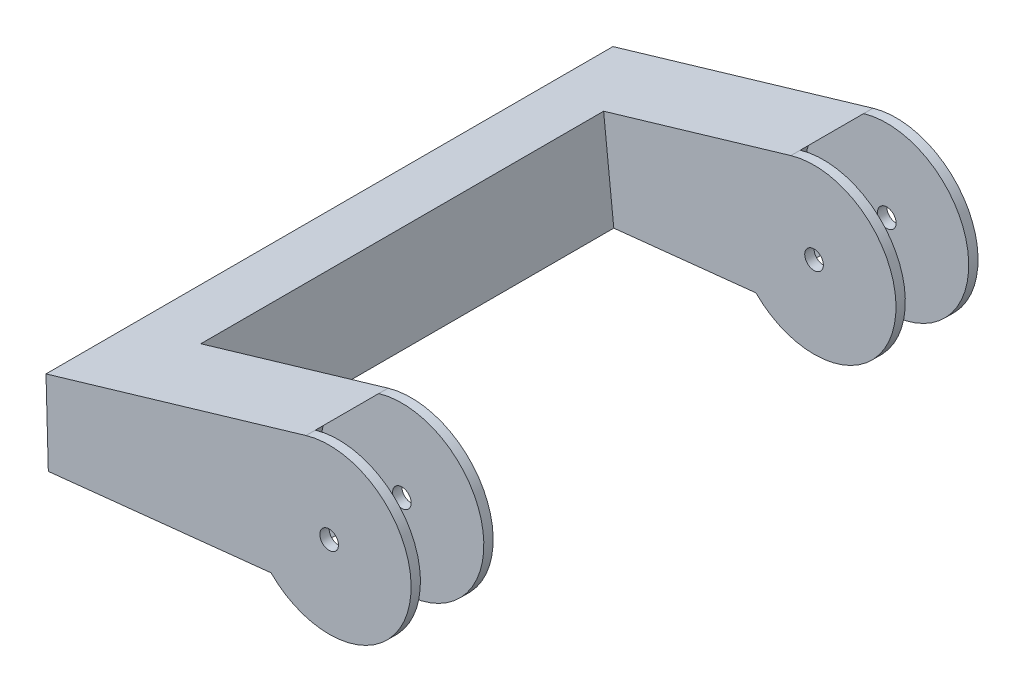
ISO-10303-21;
HEADER;
FILE_DESCRIPTION(('STEP AP214'),'2;1');
FILE_NAME('part.step','',(''),(''),'','','');
FILE_SCHEMA(('AUTOMOTIVE_DESIGN { 1 0 10303 214 1 1 1 1 }'));
ENDSEC;
DATA;
#1=APPLICATION_CONTEXT('core data for automotive mechanical design processes');
#2=APPLICATION_PROTOCOL_DEFINITION('international standard','automotive_design',2000,#1);
#3=PRODUCT_CONTEXT('',#1,'mechanical');
#4=PRODUCT('Part','Part','',(#3));
#5=PRODUCT_RELATED_PRODUCT_CATEGORY('part','',(#4));
#6=PRODUCT_DEFINITION_FORMATION('','',#4);
#7=PRODUCT_DEFINITION_CONTEXT('part definition',#1,'design');
#8=PRODUCT_DEFINITION('design','',#6,#7);
#9=PRODUCT_DEFINITION_SHAPE('','',#8);
#10=(LENGTH_UNIT() NAMED_UNIT(*) SI_UNIT(.MILLI.,.METRE.));
#11=(NAMED_UNIT(*) PLANE_ANGLE_UNIT() SI_UNIT($,.RADIAN.));
#12=(NAMED_UNIT(*) SI_UNIT($,.STERADIAN.) SOLID_ANGLE_UNIT());
#13=UNCERTAINTY_MEASURE_WITH_UNIT(LENGTH_MEASURE(1.E-05),#10,'distance_accuracy_value','');
#14=(GEOMETRIC_REPRESENTATION_CONTEXT(3) GLOBAL_UNCERTAINTY_ASSIGNED_CONTEXT((#13)) GLOBAL_UNIT_ASSIGNED_CONTEXT((#10,
#11,#12)) REPRESENTATION_CONTEXT('',''));
#15=CARTESIAN_POINT('',(0.,0.,0.));
#16=DIRECTION('',(0.,0.,1.));
#17=DIRECTION('',(1.,0.,0.));
#18=AXIS2_PLACEMENT_3D('',#15,#16,#17);
#19=CARTESIAN_POINT('',(0.,0.,-11.));
#20=DIRECTION('',(0.,0.,1.));
#21=DIRECTION('',(1.,0.,0.));
#22=AXIS2_PLACEMENT_3D('',#19,#20,#21);
#23=PLANE('',#22);
#24=CARTESIAN_POINT('',(0.,0.,-11.));
#25=DIRECTION('',(0.,0.,1.));
#26=DIRECTION('',(1.,0.,0.));
#27=AXIS2_PLACEMENT_3D('',#24,#25,#26);
#28=CIRCLE('',#27,2.5);
#29=CARTESIAN_POINT('',(2.5,0.,-11.));
#30=VERTEX_POINT('',#29);
#31=EDGE_CURVE('E254',#30,#30,#28,.T.);
#32=ORIENTED_EDGE('',*,*,#31,.T.);
#33=EDGE_LOOP('',(#32));
#34=FACE_BOUND('',#33,.T.);
#35=DIRECTION('',(0.105116484730748,-0.99445991605386,0.));
#36=VECTOR('',#35,1.);
#37=CARTESIAN_POINT('',(-55.1330063569683,-5.82767362195887,-11.));
#38=LINE('',#37,#36);
#39=CARTESIAN_POINT('',(-56.4126612267271,6.27856716052013,-11.));
#40=VERTEX_POINT('',#39);
#41=CARTESIAN_POINT('',(-53.6859194237052,-19.5179140619969,-11.));
#42=VERTEX_POINT('',#41);
#43=EDGE_CURVE('E54',#40,#42,#38,.T.);
#44=ORIENTED_EDGE('',*,*,#43,.F.);
#45=DIRECTION('',(-0.959213834506893,-0.282681480982719,0.));
#46=VECTOR('',#45,1.);
#47=CARTESIAN_POINT('',(-75.916524457056,0.530754999670662,-11.));
#48=LINE('',#47,#46);
#49=CARTESIAN_POINT('',(-6.21031513731404,21.073259470872,-11.));
#50=VERTEX_POINT('',#49);
#51=EDGE_CURVE('E217',#50,#40,#48,.T.);
#52=ORIENTED_EDGE('',*,*,#51,.F.);
#53=CARTESIAN_POINT('',(0.,0.,-11.));
#54=DIRECTION('',(0.,0.,1.));
#55=DIRECTION('',(1.,0.,0.));
#56=AXIS2_PLACEMENT_3D('',#53,#54,#55);
#57=CIRCLE('',#56,21.9693031029992);
#58=CARTESIAN_POINT('',(-15.5792034190395,-15.4899547985021,-11.));
#59=VERTEX_POINT('',#58);
#60=EDGE_CURVE('E229',#59,#50,#57,.T.);
#61=ORIENTED_EDGE('',*,*,#60,.F.);
#62=DIRECTION('',(0.99445991605386,0.105116484730748,0.));
#63=VECTOR('',#62,1.);
#64=CARTESIAN_POINT('',(-75.2941351020167,-21.8019474722333,-11.));
#65=LINE('',#64,#63);
#66=EDGE_CURVE('E230',#42,#59,#65,.T.);
#67=ORIENTED_EDGE('',*,*,#66,.F.);
#68=EDGE_LOOP('',(#44,#52,#61,#67));
#69=FACE_BOUND('',#68,.T.);
#70=ADVANCED_FACE('F37',(#34,#69),#23,.F.);
#71=CARTESIAN_POINT('',(0.,0.,11.));
#72=DIRECTION('',(0.,0.,-1.));
#73=DIRECTION('',(-1.,0.,0.));
#74=AXIS2_PLACEMENT_3D('',#71,#72,#73);
#75=CYLINDRICAL_SURFACE('',#74,21.9693031029992);
#76=CARTESIAN_POINT('',(0.,0.,-8.50000000000006));
#77=DIRECTION('',(0.,0.,1.));
#78=DIRECTION('',(1.,0.,0.));
#79=AXIS2_PLACEMENT_3D('',#76,#77,#78);
#80=CIRCLE('',#79,21.9693031029992);
#81=CARTESIAN_POINT('',(-15.5792034190395,-15.4899547985021,-8.50000000000006));
#82=VERTEX_POINT('',#81);
#83=CARTESIAN_POINT('',(-6.21031513731404,21.073259470872,-8.50000000000006));
#84=VERTEX_POINT('',#83);
#85=EDGE_CURVE('E358',#82,#84,#80,.T.);
#86=ORIENTED_EDGE('',*,*,#85,.F.);
#87=DIRECTION('',(0.,0.,-1.));
#88=VECTOR('',#87,1.);
#89=CARTESIAN_POINT('',(-15.5792034190395,-15.4899547985021,11.));
#90=LINE('',#89,#88);
#91=EDGE_CURVE('E46',#82,#59,#90,.T.);
#92=ORIENTED_EDGE('',*,*,#91,.T.);
#93=ORIENTED_EDGE('',*,*,#60,.T.);
#94=DIRECTION('',(0.,0.,-1.));
#95=VECTOR('',#94,1.);
#96=CARTESIAN_POINT('',(-6.21031513731404,21.073259470872,11.));
#97=LINE('',#96,#95);
#98=EDGE_CURVE('E241',#84,#50,#97,.T.);
#99=ORIENTED_EDGE('',*,*,#98,.F.);
#100=EDGE_LOOP('',(#86,#92,#93,#99));
#101=FACE_BOUND('',#100,.T.);
#102=ADVANCED_FACE('F311',(#101),#75,.T.);
#103=CARTESIAN_POINT('',(0.,0.,11.));
#104=DIRECTION('',(0.,0.,-1.));
#105=DIRECTION('',(-1.,0.,0.));
#106=AXIS2_PLACEMENT_3D('',#103,#104,#105);
#107=CYLINDRICAL_SURFACE('',#106,2.5);
#108=ORIENTED_EDGE('',*,*,#31,.F.);
#109=EDGE_LOOP('',(#108));
#110=FACE_BOUND('',#109,.T.);
#111=CARTESIAN_POINT('',(0.,0.,-8.50000000000006));
#112=DIRECTION('',(0.,0.,1.));
#113=DIRECTION('',(1.,0.,0.));
#114=AXIS2_PLACEMENT_3D('',#111,#112,#113);
#115=CIRCLE('',#114,2.5);
#116=CARTESIAN_POINT('',(2.5,0.,-8.50000000000006));
#117=VERTEX_POINT('',#116);
#118=EDGE_CURVE('E248',#117,#117,#115,.T.);
#119=ORIENTED_EDGE('',*,*,#118,.T.);
#120=EDGE_LOOP('',(#119));
#121=FACE_BOUND('',#120,.T.);
#122=ADVANCED_FACE('F317',(#110,#121),#107,.F.);
#123=CARTESIAN_POINT('',(0.,0.,11.));
#124=DIRECTION('',(0.,0.,1.));
#125=DIRECTION('',(1.,0.,0.));
#126=AXIS2_PLACEMENT_3D('',#123,#124,#125);
#127=PLANE('',#126);
#128=DIRECTION('',(0.99445991605386,0.105116484730748,0.));
#129=VECTOR('',#128,1.);
#130=CARTESIAN_POINT('',(-75.2941351020167,-21.8019474722333,11.));
#131=LINE('',#130,#129);
#132=CARTESIAN_POINT('',(-75.2941351020167,-21.8019474722333,11.));
#133=VERTEX_POINT('',#132);
#134=CARTESIAN_POINT('',(-15.5792034190395,-15.4899547985021,11.));
#135=VERTEX_POINT('',#134);
#136=EDGE_CURVE('E228',#133,#135,#131,.T.);
#137=ORIENTED_EDGE('',*,*,#136,.T.);
#138=CARTESIAN_POINT('',(0.,0.,11.));
#139=DIRECTION('',(0.,0.,1.));
#140=DIRECTION('',(1.,0.,0.));
#141=AXIS2_PLACEMENT_3D('',#138,#139,#140);
#142=CIRCLE('',#141,21.9693031029992);
#143=CARTESIAN_POINT('',(-6.21031513731404,21.073259470872,11.));
#144=VERTEX_POINT('',#143);
#145=EDGE_CURVE('E266',#135,#144,#142,.T.);
#146=ORIENTED_EDGE('',*,*,#145,.T.);
#147=DIRECTION('',(-0.959213834506893,-0.282681480982719,0.));
#148=VECTOR('',#147,1.);
#149=CARTESIAN_POINT('',(-75.916524457056,0.530754999670662,11.));
#150=LINE('',#149,#148);
#151=CARTESIAN_POINT('',(-75.916524457056,0.530754999670662,11.));
#152=VERTEX_POINT('',#151);
#153=EDGE_CURVE('E268',#144,#152,#150,.T.);
#154=ORIENTED_EDGE('',*,*,#153,.T.);
#155=DIRECTION('',(0.0278581509804419,-0.99961188639589,0.));
#156=VECTOR('',#155,1.);
#157=CARTESIAN_POINT('',(-75.2941351020167,-21.8019474722333,11.));
#158=LINE('',#157,#156);
#159=EDGE_CURVE('E239',#152,#133,#158,.T.);
#160=ORIENTED_EDGE('',*,*,#159,.T.);
#161=EDGE_LOOP('',(#137,#146,#154,#160));
#162=FACE_BOUND('',#161,.T.);
#163=CARTESIAN_POINT('',(0.,0.,11.));
#164=DIRECTION('',(0.,0.,1.));
#165=DIRECTION('',(1.,0.,0.));
#166=AXIS2_PLACEMENT_3D('',#163,#164,#165);
#167=CIRCLE('',#166,2.5);
#168=CARTESIAN_POINT('',(2.5,0.,11.));
#169=VERTEX_POINT('',#168);
#170=EDGE_CURVE('E259',#169,#169,#167,.T.);
#171=ORIENTED_EDGE('',*,*,#170,.F.);
#172=EDGE_LOOP('',(#171));
#173=FACE_BOUND('',#172,.T.);
#174=ADVANCED_FACE('F274',(#162,#173),#127,.T.);
#175=CARTESIAN_POINT('',(-75.2941351020167,-21.8019474722333,11.));
#176=DIRECTION('',(-0.105116484730748,0.99445991605386,0.));
#177=DIRECTION('',(-0.99445991605386,-0.105116484730748,0.));
#178=AXIS2_PLACEMENT_3D('',#175,#176,#177);
#179=PLANE('',#178);
#180=DIRECTION('',(0.,0.,-1.));
#181=VECTOR('',#180,1.);
#182=CARTESIAN_POINT('',(-75.2941351020167,-21.8019474722333,11.));
#183=LINE('',#182,#181);
#184=CARTESIAN_POINT('',(-75.2941351020167,-21.8019474722333,-141.));
#185=VERTEX_POINT('',#184);
#186=EDGE_CURVE('E236',#133,#185,#183,.T.);
#187=ORIENTED_EDGE('',*,*,#186,.T.);
#188=DIRECTION('',(0.99445991605386,0.105116484730748,0.));
#189=VECTOR('',#188,1.);
#190=CARTESIAN_POINT('',(-75.2941351020167,-21.8019474722333,-141.));
#191=LINE('',#190,#189);
#192=CARTESIAN_POINT('',(-15.5792034190395,-15.4899547985021,-141.));
#193=VERTEX_POINT('',#192);
#194=EDGE_CURVE('E179',#185,#193,#191,.T.);
#195=ORIENTED_EDGE('',*,*,#194,.T.);
#196=DIRECTION('',(0.,0.,1.));
#197=VECTOR('',#196,1.);
#198=CARTESIAN_POINT('',(-15.5792034190395,-15.4899547985021,-141.));
#199=LINE('',#198,#197);
#200=CARTESIAN_POINT('',(-15.5792034190395,-15.4899547985021,-138.5));
#201=VERTEX_POINT('',#200);
#202=EDGE_CURVE('E199',#193,#201,#199,.T.);
#203=ORIENTED_EDGE('',*,*,#202,.T.);
#204=DIRECTION('',(0.,0.,-1.));
#205=VECTOR('',#204,1.);
#206=CARTESIAN_POINT('',(-15.5792034190395,-15.4899547985021,-121.5));
#207=LINE('',#206,#205);
#208=CARTESIAN_POINT('',(-15.5792034190395,-15.4899547985021,-121.5));
#209=VERTEX_POINT('',#208);
#210=EDGE_CURVE('E170',#209,#201,#207,.T.);
#211=ORIENTED_EDGE('',*,*,#210,.F.);
#212=CARTESIAN_POINT('',(-15.5792034190395,-15.4899547985021,-119.));
#213=VERTEX_POINT('',#212);
#214=EDGE_CURVE('E142',#209,#213,#199,.T.);
#215=ORIENTED_EDGE('',*,*,#214,.T.);
#216=DIRECTION('',(0.99445991605386,0.105116484730748,0.));
#217=VECTOR('',#216,1.);
#218=CARTESIAN_POINT('',(-75.2941351020167,-21.8019474722333,-119.));
#219=LINE('',#218,#217);
#220=CARTESIAN_POINT('',(-53.6859194237052,-19.5179140619969,-119.));
#221=VERTEX_POINT('',#220);
#222=EDGE_CURVE('E139',#221,#213,#219,.T.);
#223=ORIENTED_EDGE('',*,*,#222,.F.);
#224=DIRECTION('',(0.,0.,1.));
#225=VECTOR('',#224,1.);
#226=CARTESIAN_POINT('',(-53.6859194237052,-19.5179140619969,-100.815012246112));
#227=LINE('',#226,#225);
#228=EDGE_CURVE('E129',#221,#42,#227,.T.);
#229=ORIENTED_EDGE('',*,*,#228,.T.);
#230=ORIENTED_EDGE('',*,*,#66,.T.);
#231=ORIENTED_EDGE('',*,*,#91,.F.);
#232=DIRECTION('',(0.,0.,1.));
#233=VECTOR('',#232,1.);
#234=CARTESIAN_POINT('',(-15.5792034190395,-15.4899547985021,-8.50000000000006));
#235=LINE('',#234,#233);
#236=CARTESIAN_POINT('',(-15.5792034190395,-15.4899547985021,8.50000000000006));
#237=VERTEX_POINT('',#236);
#238=EDGE_CURVE('E250',#82,#237,#235,.T.);
#239=ORIENTED_EDGE('',*,*,#238,.T.);
#240=EDGE_CURVE('E11',#135,#237,#90,.T.);
#241=ORIENTED_EDGE('',*,*,#240,.F.);
#242=ORIENTED_EDGE('',*,*,#136,.F.);
#243=EDGE_LOOP('',(#187,#195,#203,#211,#215,#223,#229,#230,#231,#239,#241,#242));
#244=FACE_BOUND('',#243,.T.);
#245=ADVANCED_FACE('F39',(#244),#179,.F.);
#246=ORIENTED_EDGE('',*,*,#240,.T.);
#247=CARTESIAN_POINT('',(0.,0.,8.50000000000006));
#248=DIRECTION('',(0.,0.,1.));
#249=DIRECTION('',(1.,0.,0.));
#250=AXIS2_PLACEMENT_3D('',#247,#248,#249);
#251=CIRCLE('',#250,21.9693031029992);
#252=CARTESIAN_POINT('',(-6.21031513731404,21.073259470872,8.50000000000006));
#253=VERTEX_POINT('',#252);
#254=EDGE_CURVE('E218',#237,#253,#251,.T.);
#255=ORIENTED_EDGE('',*,*,#254,.T.);
#256=EDGE_CURVE('E242',#144,#253,#97,.T.);
#257=ORIENTED_EDGE('',*,*,#256,.F.);
#258=ORIENTED_EDGE('',*,*,#145,.F.);
#259=EDGE_LOOP('',(#246,#255,#257,#258));
#260=FACE_BOUND('',#259,.T.);
#261=ADVANCED_FACE('F284',(#260),#75,.T.);
#262=CARTESIAN_POINT('',(-75.916524457056,0.530754999670662,11.));
#263=DIRECTION('',(0.282681480982719,-0.959213834506893,0.));
#264=DIRECTION('',(0.959213834506893,0.282681480982719,0.));
#265=AXIS2_PLACEMENT_3D('',#262,#263,#264);
#266=PLANE('',#265);
#267=ORIENTED_EDGE('',*,*,#51,.T.);
#268=DIRECTION('',(0.,0.,1.));
#269=VECTOR('',#268,1.);
#270=CARTESIAN_POINT('',(-56.4126612267271,6.27856716052013,-100.815012246112));
#271=LINE('',#270,#269);
#272=CARTESIAN_POINT('',(-56.4126612267271,6.27856716052013,-119.));
#273=VERTEX_POINT('',#272);
#274=EDGE_CURVE('E136',#273,#40,#271,.T.);
#275=ORIENTED_EDGE('',*,*,#274,.F.);
#276=DIRECTION('',(-0.959213834506893,-0.282681480982719,0.));
#277=VECTOR('',#276,1.);
#278=CARTESIAN_POINT('',(-75.916524457056,0.530754999670662,-119.));
#279=LINE('',#278,#277);
#280=CARTESIAN_POINT('',(-6.21031513731404,21.073259470872,-119.));
#281=VERTEX_POINT('',#280);
#282=EDGE_CURVE('E152',#281,#273,#279,.T.);
#283=ORIENTED_EDGE('',*,*,#282,.F.);
#284=DIRECTION('',(0.,0.,1.));
#285=VECTOR('',#284,1.);
#286=CARTESIAN_POINT('',(-6.21031513731404,21.073259470872,-141.));
#287=LINE('',#286,#285);
#288=CARTESIAN_POINT('',(-6.21031513731404,21.073259470872,-121.5));
#289=VERTEX_POINT('',#288);
#290=EDGE_CURVE('E191',#289,#281,#287,.T.);
#291=ORIENTED_EDGE('',*,*,#290,.F.);
#292=CARTESIAN_POINT('',(-6.21031513731404,21.073259470872,-138.5));
#293=VERTEX_POINT('',#292);
#294=EDGE_CURVE('E204',#293,#289,#287,.T.);
#295=ORIENTED_EDGE('',*,*,#294,.F.);
#296=CARTESIAN_POINT('',(-6.21031513731404,21.073259470872,-141.));
#297=VERTEX_POINT('',#296);
#298=EDGE_CURVE('E202',#297,#293,#287,.T.);
#299=ORIENTED_EDGE('',*,*,#298,.F.);
#300=DIRECTION('',(-0.959213834506893,-0.282681480982719,0.));
#301=VECTOR('',#300,1.);
#302=CARTESIAN_POINT('',(-75.916524457056,0.530754999670662,-141.));
#303=LINE('',#302,#301);
#304=CARTESIAN_POINT('',(-75.916524457056,0.530754999670662,-141.));
#305=VERTEX_POINT('',#304);
#306=EDGE_CURVE('E185',#297,#305,#303,.T.);
#307=ORIENTED_EDGE('',*,*,#306,.T.);
#308=DIRECTION('',(0.,0.,-1.));
#309=VECTOR('',#308,1.);
#310=CARTESIAN_POINT('',(-75.916524457056,0.530754999670662,11.));
#311=LINE('',#310,#309);
#312=EDGE_CURVE('E238',#152,#305,#311,.T.);
#313=ORIENTED_EDGE('',*,*,#312,.F.);
#314=ORIENTED_EDGE('',*,*,#153,.F.);
#315=ORIENTED_EDGE('',*,*,#256,.T.);
#316=EDGE_CURVE('E244',#253,#84,#97,.T.);
#317=ORIENTED_EDGE('',*,*,#316,.T.);
#318=ORIENTED_EDGE('',*,*,#98,.T.);
#319=EDGE_LOOP('',(#267,#275,#283,#291,#295,#299,#307,#313,#314,#315,#317,#318));
#320=FACE_BOUND('',#319,.T.);
#321=ADVANCED_FACE('F216',(#320),#266,.F.);
#322=CARTESIAN_POINT('',(-75.2941351020167,-21.8019474722333,11.));
#323=DIRECTION('',(0.999611886395891,0.0278581509804419,0.));
#324=DIRECTION('',(-0.0278581509804419,0.999611886395891,0.));
#325=AXIS2_PLACEMENT_3D('',#322,#323,#324);
#326=PLANE('',#325);
#327=ORIENTED_EDGE('',*,*,#312,.T.);
#328=DIRECTION('',(0.0278581509804419,-0.99961188639589,0.));
#329=VECTOR('',#328,1.);
#330=CARTESIAN_POINT('',(-75.2941351020167,-21.8019474722333,-141.));
#331=LINE('',#330,#329);
#332=EDGE_CURVE('E188',#305,#185,#331,.T.);
#333=ORIENTED_EDGE('',*,*,#332,.T.);
#334=ORIENTED_EDGE('',*,*,#186,.F.);
#335=ORIENTED_EDGE('',*,*,#159,.F.);
#336=EDGE_LOOP('',(#327,#333,#334,#335));
#337=FACE_BOUND('',#336,.T.);
#338=ADVANCED_FACE('F280',(#337),#326,.F.);
#339=CARTESIAN_POINT('',(0.,0.,8.50000000000006));
#340=DIRECTION('',(0.,0.,1.));
#341=DIRECTION('',(1.,0.,0.));
#342=AXIS2_PLACEMENT_3D('',#339,#340,#341);
#343=CIRCLE('',#342,2.5);
#344=CARTESIAN_POINT('',(2.5,0.,8.50000000000006));
#345=VERTEX_POINT('',#344);
#346=EDGE_CURVE('E246',#345,#345,#343,.T.);
#347=ORIENTED_EDGE('',*,*,#346,.F.);
#348=EDGE_LOOP('',(#347));
#349=FACE_BOUND('',#348,.T.);
#350=ORIENTED_EDGE('',*,*,#170,.T.);
#351=EDGE_LOOP('',(#350));
#352=FACE_BOUND('',#351,.T.);
#353=ADVANCED_FACE('F324',(#349,#352),#107,.F.);
#354=CARTESIAN_POINT('',(0.,0.,-8.50000000000006));
#355=DIRECTION('',(0.,0.,1.));
#356=DIRECTION('',(1.,0.,0.));
#357=AXIS2_PLACEMENT_3D('',#354,#355,#356);
#358=CYLINDRICAL_SURFACE('',#357,21.9693031029992);
#359=EDGE_CURVE('E62',#84,#82,#80,.T.);
#360=ORIENTED_EDGE('',*,*,#359,.F.);
#361=ORIENTED_EDGE('',*,*,#316,.F.);
#362=EDGE_CURVE('E220',#253,#237,#251,.T.);
#363=ORIENTED_EDGE('',*,*,#362,.T.);
#364=ORIENTED_EDGE('',*,*,#238,.F.);
#365=EDGE_LOOP('',(#360,#361,#363,#364));
#366=FACE_BOUND('',#365,.T.);
#367=ADVANCED_FACE('F342',(#366),#358,.F.);
#368=CARTESIAN_POINT('',(0.,0.,-8.50000000000006));
#369=DIRECTION('',(0.,0.,1.));
#370=DIRECTION('',(1.,0.,0.));
#371=AXIS2_PLACEMENT_3D('',#368,#369,#370);
#372=PLANE('',#371);
#373=ORIENTED_EDGE('',*,*,#118,.F.);
#374=EDGE_LOOP('',(#373));
#375=FACE_BOUND('',#374,.T.);
#376=ORIENTED_EDGE('',*,*,#359,.T.);
#377=ORIENTED_EDGE('',*,*,#85,.T.);
#378=EDGE_LOOP('',(#376,#377));
#379=FACE_BOUND('',#378,.T.);
#380=ADVANCED_FACE('F347',(#375,#379),#372,.T.);
#381=CARTESIAN_POINT('',(0.,0.,8.50000000000006));
#382=DIRECTION('',(0.,0.,1.));
#383=DIRECTION('',(1.,0.,0.));
#384=AXIS2_PLACEMENT_3D('',#381,#382,#383);
#385=PLANE('',#384);
#386=ORIENTED_EDGE('',*,*,#346,.T.);
#387=EDGE_LOOP('',(#386));
#388=FACE_BOUND('',#387,.T.);
#389=ORIENTED_EDGE('',*,*,#362,.F.);
#390=ORIENTED_EDGE('',*,*,#254,.F.);
#391=EDGE_LOOP('',(#389,#390));
#392=FACE_BOUND('',#391,.T.);
#393=ADVANCED_FACE('F352',(#388,#392),#385,.F.);
#394=CARTESIAN_POINT('',(-55.1330063569683,-5.82767362195887,-100.815012246112));
#395=DIRECTION('',(-0.99445991605386,-0.105116484730748,0.));
#396=DIRECTION('',(0.105116484730748,-0.99445991605386,0.));
#397=AXIS2_PLACEMENT_3D('',#394,#395,#396);
#398=PLANE('',#397);
#399=ORIENTED_EDGE('',*,*,#228,.F.);
#400=DIRECTION('',(0.105116484730748,-0.99445991605386,0.));
#401=VECTOR('',#400,1.);
#402=CARTESIAN_POINT('',(-55.1330063569683,-5.82767362195887,-119.));
#403=LINE('',#402,#401);
#404=EDGE_CURVE('E134',#273,#221,#403,.T.);
#405=ORIENTED_EDGE('',*,*,#404,.F.);
#406=ORIENTED_EDGE('',*,*,#274,.T.);
#407=ORIENTED_EDGE('',*,*,#43,.T.);
#408=EDGE_LOOP('',(#399,#405,#406,#407));
#409=FACE_BOUND('',#408,.T.);
#410=ADVANCED_FACE('F131',(#409),#398,.F.);
#411=CARTESIAN_POINT('',(0.,0.,-119.));
#412=DIRECTION('',(0.,0.,-1.));
#413=DIRECTION('',(1.,0.,0.));
#414=AXIS2_PLACEMENT_3D('',#411,#412,#413);
#415=PLANE('',#414);
#416=CARTESIAN_POINT('',(0.,0.,-119.));
#417=DIRECTION('',(0.,0.,1.));
#418=DIRECTION('',(1.,0.,0.));
#419=AXIS2_PLACEMENT_3D('',#416,#417,#418);
#420=CIRCLE('',#419,2.5);
#421=CARTESIAN_POINT('',(2.5,0.,-119.));
#422=VERTEX_POINT('',#421);
#423=EDGE_CURVE('E173',#422,#422,#420,.T.);
#424=ORIENTED_EDGE('',*,*,#423,.F.);
#425=EDGE_LOOP('',(#424));
#426=FACE_BOUND('',#425,.T.);
#427=ORIENTED_EDGE('',*,*,#404,.T.);
#428=ORIENTED_EDGE('',*,*,#222,.T.);
#429=CARTESIAN_POINT('',(0.,0.,-119.));
#430=DIRECTION('',(0.,0.,1.));
#431=DIRECTION('',(1.,0.,0.));
#432=AXIS2_PLACEMENT_3D('',#429,#430,#431);
#433=CIRCLE('',#432,21.9693031029992);
#434=EDGE_CURVE('E146',#213,#281,#433,.T.);
#435=ORIENTED_EDGE('',*,*,#434,.T.);
#436=ORIENTED_EDGE('',*,*,#282,.T.);
#437=EDGE_LOOP('',(#427,#428,#435,#436));
#438=FACE_BOUND('',#437,.T.);
#439=ADVANCED_FACE('F150',(#426,#438),#415,.F.);
#440=CARTESIAN_POINT('',(0.,0.,-141.));
#441=DIRECTION('',(0.,0.,1.));
#442=DIRECTION('',(-1.,0.,0.));
#443=AXIS2_PLACEMENT_3D('',#440,#441,#442);
#444=CYLINDRICAL_SURFACE('',#443,21.9693031029992);
#445=CARTESIAN_POINT('',(0.,0.,-121.5));
#446=DIRECTION('',(0.,0.,1.));
#447=DIRECTION('',(1.,0.,0.));
#448=AXIS2_PLACEMENT_3D('',#445,#446,#447);
#449=CIRCLE('',#448,21.9693031029992);
#450=EDGE_CURVE('E168',#209,#289,#449,.T.);
#451=ORIENTED_EDGE('',*,*,#450,.T.);
#452=ORIENTED_EDGE('',*,*,#290,.T.);
#453=ORIENTED_EDGE('',*,*,#434,.F.);
#454=ORIENTED_EDGE('',*,*,#214,.F.);
#455=EDGE_LOOP('',(#451,#452,#453,#454));
#456=FACE_BOUND('',#455,.T.);
#457=ADVANCED_FACE('F212',(#456),#444,.T.);
#458=CARTESIAN_POINT('',(0.,0.,-141.));
#459=DIRECTION('',(0.,0.,1.));
#460=DIRECTION('',(-1.,0.,0.));
#461=AXIS2_PLACEMENT_3D('',#458,#459,#460);
#462=CYLINDRICAL_SURFACE('',#461,2.5);
#463=ORIENTED_EDGE('',*,*,#423,.T.);
#464=EDGE_LOOP('',(#463));
#465=FACE_BOUND('',#464,.T.);
#466=CARTESIAN_POINT('',(0.,0.,-121.5));
#467=DIRECTION('',(0.,0.,1.));
#468=DIRECTION('',(1.,0.,0.));
#469=AXIS2_PLACEMENT_3D('',#466,#467,#468);
#470=CIRCLE('',#469,2.5);
#471=CARTESIAN_POINT('',(2.5,0.,-121.5));
#472=VERTEX_POINT('',#471);
#473=EDGE_CURVE('E174',#472,#472,#470,.T.);
#474=ORIENTED_EDGE('',*,*,#473,.F.);
#475=EDGE_LOOP('',(#474));
#476=FACE_BOUND('',#475,.T.);
#477=ADVANCED_FACE('F380',(#465,#476),#462,.F.);
#478=CARTESIAN_POINT('',(0.,0.,-141.));
#479=DIRECTION('',(0.,0.,-1.));
#480=DIRECTION('',(1.,0.,0.));
#481=AXIS2_PLACEMENT_3D('',#478,#479,#480);
#482=PLANE('',#481);
#483=ORIENTED_EDGE('',*,*,#194,.F.);
#484=ORIENTED_EDGE('',*,*,#332,.F.);
#485=ORIENTED_EDGE('',*,*,#306,.F.);
#486=CARTESIAN_POINT('',(0.,0.,-141.));
#487=DIRECTION('',(0.,0.,1.));
#488=DIRECTION('',(1.,0.,0.));
#489=AXIS2_PLACEMENT_3D('',#486,#487,#488);
#490=CIRCLE('',#489,21.9693031029992);
#491=EDGE_CURVE('E182',#193,#297,#490,.T.);
#492=ORIENTED_EDGE('',*,*,#491,.F.);
#493=EDGE_LOOP('',(#483,#484,#485,#492));
#494=FACE_BOUND('',#493,.T.);
#495=CARTESIAN_POINT('',(0.,0.,-141.));
#496=DIRECTION('',(0.,0.,1.));
#497=DIRECTION('',(1.,0.,0.));
#498=AXIS2_PLACEMENT_3D('',#495,#496,#497);
#499=CIRCLE('',#498,2.5);
#500=CARTESIAN_POINT('',(2.5,0.,-141.));
#501=VERTEX_POINT('',#500);
#502=EDGE_CURVE('E147',#501,#501,#499,.T.);
#503=ORIENTED_EDGE('',*,*,#502,.T.);
#504=EDGE_LOOP('',(#503));
#505=FACE_BOUND('',#504,.T.);
#506=ADVANCED_FACE('F290',(#494,#505),#482,.T.);
#507=ORIENTED_EDGE('',*,*,#202,.F.);
#508=ORIENTED_EDGE('',*,*,#491,.T.);
#509=ORIENTED_EDGE('',*,*,#298,.T.);
#510=CARTESIAN_POINT('',(0.,0.,-138.5));
#511=DIRECTION('',(0.,0.,1.));
#512=DIRECTION('',(1.,0.,0.));
#513=AXIS2_PLACEMENT_3D('',#510,#511,#512);
#514=CIRCLE('',#513,21.9693031029992);
#515=EDGE_CURVE('E153',#201,#293,#514,.T.);
#516=ORIENTED_EDGE('',*,*,#515,.F.);
#517=EDGE_LOOP('',(#507,#508,#509,#516));
#518=FACE_BOUND('',#517,.T.);
#519=ADVANCED_FACE('F292',(#518),#444,.T.);
#520=CARTESIAN_POINT('',(0.,0.,-138.5));
#521=DIRECTION('',(0.,0.,1.));
#522=DIRECTION('',(1.,0.,0.));
#523=AXIS2_PLACEMENT_3D('',#520,#521,#522);
#524=CIRCLE('',#523,2.5);
#525=CARTESIAN_POINT('',(2.5,0.,-138.5));
#526=VERTEX_POINT('',#525);
#527=EDGE_CURVE('E167',#526,#526,#524,.T.);
#528=ORIENTED_EDGE('',*,*,#527,.T.);
#529=EDGE_LOOP('',(#528));
#530=FACE_BOUND('',#529,.T.);
#531=ORIENTED_EDGE('',*,*,#502,.F.);
#532=EDGE_LOOP('',(#531));
#533=FACE_BOUND('',#532,.T.);
#534=ADVANCED_FACE('F308',(#530,#533),#462,.F.);
#535=CARTESIAN_POINT('',(0.,0.,-121.5));
#536=DIRECTION('',(0.,0.,-1.));
#537=DIRECTION('',(1.,0.,0.));
#538=AXIS2_PLACEMENT_3D('',#535,#536,#537);
#539=CYLINDRICAL_SURFACE('',#538,21.9693031029992);
#540=EDGE_CURVE('E166',#289,#209,#449,.T.);
#541=ORIENTED_EDGE('',*,*,#540,.T.);
#542=ORIENTED_EDGE('',*,*,#210,.T.);
#543=EDGE_CURVE('E156',#293,#201,#514,.T.);
#544=ORIENTED_EDGE('',*,*,#543,.F.);
#545=ORIENTED_EDGE('',*,*,#294,.T.);
#546=EDGE_LOOP('',(#541,#542,#544,#545));
#547=FACE_BOUND('',#546,.T.);
#548=ADVANCED_FACE('F295',(#547),#539,.F.);
#549=CARTESIAN_POINT('',(0.,0.,-121.5));
#550=DIRECTION('',(0.,0.,-1.));
#551=DIRECTION('',(1.,0.,0.));
#552=AXIS2_PLACEMENT_3D('',#549,#550,#551);
#553=PLANE('',#552);
#554=ORIENTED_EDGE('',*,*,#473,.T.);
#555=EDGE_LOOP('',(#554));
#556=FACE_BOUND('',#555,.T.);
#557=ORIENTED_EDGE('',*,*,#540,.F.);
#558=ORIENTED_EDGE('',*,*,#450,.F.);
#559=EDGE_LOOP('',(#557,#558));
#560=FACE_BOUND('',#559,.T.);
#561=ADVANCED_FACE('F297',(#556,#560),#553,.T.);
#562=CARTESIAN_POINT('',(0.,0.,-138.5));
#563=DIRECTION('',(0.,0.,-1.));
#564=DIRECTION('',(1.,0.,0.));
#565=AXIS2_PLACEMENT_3D('',#562,#563,#564);
#566=PLANE('',#565);
#567=ORIENTED_EDGE('',*,*,#527,.F.);
#568=EDGE_LOOP('',(#567));
#569=FACE_BOUND('',#568,.T.);
#570=ORIENTED_EDGE('',*,*,#543,.T.);
#571=ORIENTED_EDGE('',*,*,#515,.T.);
#572=EDGE_LOOP('',(#570,#571));
#573=FACE_BOUND('',#572,.T.);
#574=ADVANCED_FACE('F299',(#569,#573),#566,.F.);
#575=CLOSED_SHELL('',(#70,#102,#122,#174,#245,#261,#321,#338,#353,#367,#380,#393,#410,#439,#457,
#477,#506,#519,#534,#548,#561,#574));
#576=MANIFOLD_SOLID_BREP('B2',#575);
#577=ADVANCED_BREP_SHAPE_REPRESENTATION('',(#18,#576),#14);
#578=SHAPE_DEFINITION_REPRESENTATION(#9,#577);
ENDSEC;
END-ISO-10303-21;
